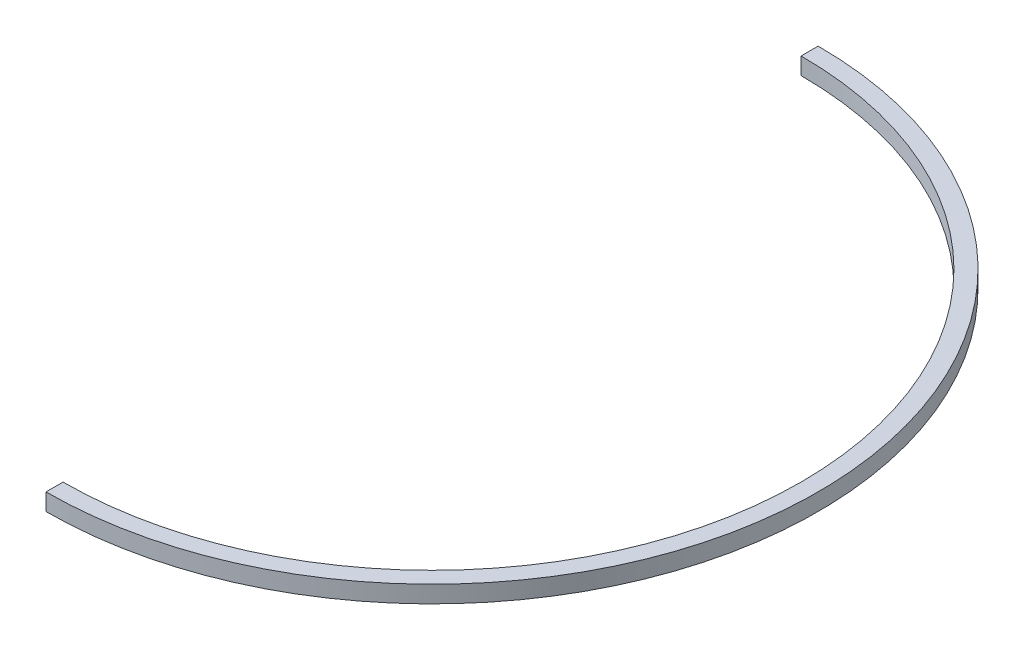
ISO-10303-21;
HEADER;
FILE_DESCRIPTION(('STEP AP214'),'2;1');
FILE_NAME('part.step','',(''),(''),'','','');
FILE_SCHEMA(('AUTOMOTIVE_DESIGN { 1 0 10303 214 1 1 1 1 }'));
ENDSEC;
DATA;
#1=APPLICATION_CONTEXT('core data for automotive mechanical design processes');
#2=APPLICATION_PROTOCOL_DEFINITION('international standard','automotive_design',2000,#1);
#3=PRODUCT_CONTEXT('',#1,'mechanical');
#4=PRODUCT('Part','Part','',(#3));
#5=PRODUCT_RELATED_PRODUCT_CATEGORY('part','',(#4));
#6=PRODUCT_DEFINITION_FORMATION('','',#4);
#7=PRODUCT_DEFINITION_CONTEXT('part definition',#1,'design');
#8=PRODUCT_DEFINITION('design','',#6,#7);
#9=PRODUCT_DEFINITION_SHAPE('','',#8);
#10=(LENGTH_UNIT() NAMED_UNIT(*) SI_UNIT(.MILLI.,.METRE.));
#11=(NAMED_UNIT(*) PLANE_ANGLE_UNIT() SI_UNIT($,.RADIAN.));
#12=(NAMED_UNIT(*) SI_UNIT($,.STERADIAN.) SOLID_ANGLE_UNIT());
#13=UNCERTAINTY_MEASURE_WITH_UNIT(LENGTH_MEASURE(1.E-05),#10,'distance_accuracy_value','');
#14=(GEOMETRIC_REPRESENTATION_CONTEXT(3) GLOBAL_UNCERTAINTY_ASSIGNED_CONTEXT((#13)) GLOBAL_UNIT_ASSIGNED_CONTEXT((#10,
#11,#12)) REPRESENTATION_CONTEXT('',''));
#15=CARTESIAN_POINT('',(0.,0.,0.));
#16=DIRECTION('',(0.,0.,1.));
#17=DIRECTION('',(1.,0.,0.));
#18=AXIS2_PLACEMENT_3D('',#15,#16,#17);
#19=CARTESIAN_POINT('',(0.,10.,0.));
#20=DIRECTION('',(0.,-1.,0.));
#21=DIRECTION('',(0.,0.,-1.));
#22=AXIS2_PLACEMENT_3D('',#19,#20,#21);
#23=CYLINDRICAL_SURFACE('',#22,226.5);
#24=CARTESIAN_POINT('',(0.,0.,0.));
#25=DIRECTION('',(0.,1.,0.));
#26=DIRECTION('',(0.,0.,1.));
#27=AXIS2_PLACEMENT_3D('',#24,#25,#26);
#28=CIRCLE('',#27,226.5);
#29=CARTESIAN_POINT('',(0.,0.,226.5));
#30=VERTEX_POINT('',#29);
#31=CARTESIAN_POINT('',(0.,0.,-226.5));
#32=VERTEX_POINT('',#31);
#33=EDGE_CURVE('E96',#30,#32,#28,.T.);
#34=ORIENTED_EDGE('',*,*,#33,.T.);
#35=DIRECTION('',(0.,-1.,0.));
#36=VECTOR('',#35,1.);
#37=CARTESIAN_POINT('',(0.,10.,-226.5));
#38=LINE('',#37,#36);
#39=CARTESIAN_POINT('',(0.,10.,-226.5));
#40=VERTEX_POINT('',#39);
#41=EDGE_CURVE('E11',#40,#32,#38,.T.);
#42=ORIENTED_EDGE('',*,*,#41,.F.);
#43=CARTESIAN_POINT('',(0.,10.,0.));
#44=DIRECTION('',(0.,1.,0.));
#45=DIRECTION('',(0.,0.,1.));
#46=AXIS2_PLACEMENT_3D('',#43,#44,#45);
#47=CIRCLE('',#46,226.5);
#48=CARTESIAN_POINT('',(0.,10.,226.5));
#49=VERTEX_POINT('',#48);
#50=EDGE_CURVE('E84',#49,#40,#47,.T.);
#51=ORIENTED_EDGE('',*,*,#50,.F.);
#52=DIRECTION('',(0.,-1.,0.));
#53=VECTOR('',#52,1.);
#54=CARTESIAN_POINT('',(0.,10.,226.5));
#55=LINE('',#54,#53);
#56=EDGE_CURVE('E92',#49,#30,#55,.T.);
#57=ORIENTED_EDGE('',*,*,#56,.T.);
#58=EDGE_LOOP('',(#34,#42,#51,#57));
#59=FACE_BOUND('',#58,.T.);
#60=ADVANCED_FACE('F33',(#59),#23,.T.);
#61=CARTESIAN_POINT('',(0.,10.,-216.5));
#62=DIRECTION('',(1.,0.,0.));
#63=DIRECTION('',(0.,0.,-1.));
#64=AXIS2_PLACEMENT_3D('',#61,#62,#63);
#65=PLANE('',#64);
#66=DIRECTION('',(0.,0.,1.));
#67=VECTOR('',#66,1.);
#68=CARTESIAN_POINT('',(0.,0.,-216.5));
#69=LINE('',#68,#67);
#70=CARTESIAN_POINT('',(0.,0.,-216.5));
#71=VERTEX_POINT('',#70);
#72=EDGE_CURVE('E88',#32,#71,#69,.T.);
#73=ORIENTED_EDGE('',*,*,#72,.T.);
#74=DIRECTION('',(0.,-1.,0.));
#75=VECTOR('',#74,1.);
#76=CARTESIAN_POINT('',(0.,10.,-216.5));
#77=LINE('',#76,#75);
#78=CARTESIAN_POINT('',(0.,10.,-216.5));
#79=VERTEX_POINT('',#78);
#80=EDGE_CURVE('E41',#79,#71,#77,.T.);
#81=ORIENTED_EDGE('',*,*,#80,.F.);
#82=DIRECTION('',(0.,0.,1.));
#83=VECTOR('',#82,1.);
#84=CARTESIAN_POINT('',(0.,10.,-216.5));
#85=LINE('',#84,#83);
#86=EDGE_CURVE('E79',#40,#79,#85,.T.);
#87=ORIENTED_EDGE('',*,*,#86,.F.);
#88=ORIENTED_EDGE('',*,*,#41,.T.);
#89=EDGE_LOOP('',(#73,#81,#87,#88));
#90=FACE_BOUND('',#89,.T.);
#91=ADVANCED_FACE('F87',(#90),#65,.F.);
#92=CARTESIAN_POINT('',(0.,10.,0.));
#93=DIRECTION('',(0.,-1.,0.));
#94=DIRECTION('',(0.,0.,-1.));
#95=AXIS2_PLACEMENT_3D('',#92,#93,#94);
#96=CYLINDRICAL_SURFACE('',#95,216.5);
#97=CARTESIAN_POINT('',(0.,0.,0.));
#98=DIRECTION('',(0.,-1.,0.));
#99=DIRECTION('',(0.,0.,1.));
#100=AXIS2_PLACEMENT_3D('',#97,#98,#99);
#101=CIRCLE('',#100,216.5);
#102=CARTESIAN_POINT('',(0.,0.,216.5));
#103=VERTEX_POINT('',#102);
#104=EDGE_CURVE('E66',#71,#103,#101,.T.);
#105=ORIENTED_EDGE('',*,*,#104,.T.);
#106=DIRECTION('',(0.,-1.,0.));
#107=VECTOR('',#106,1.);
#108=CARTESIAN_POINT('',(0.,10.,216.5));
#109=LINE('',#108,#107);
#110=CARTESIAN_POINT('',(0.,10.,216.5));
#111=VERTEX_POINT('',#110);
#112=EDGE_CURVE('E89',#111,#103,#109,.T.);
#113=ORIENTED_EDGE('',*,*,#112,.F.);
#114=CARTESIAN_POINT('',(0.,10.,0.));
#115=DIRECTION('',(0.,-1.,0.));
#116=DIRECTION('',(0.,0.,1.));
#117=AXIS2_PLACEMENT_3D('',#114,#115,#116);
#118=CIRCLE('',#117,216.5);
#119=EDGE_CURVE('E82',#79,#111,#118,.T.);
#120=ORIENTED_EDGE('',*,*,#119,.F.);
#121=ORIENTED_EDGE('',*,*,#80,.T.);
#122=EDGE_LOOP('',(#105,#113,#120,#121));
#123=FACE_BOUND('',#122,.T.);
#124=ADVANCED_FACE('F90',(#123),#96,.F.);
#125=CARTESIAN_POINT('',(0.,10.,216.5));
#126=DIRECTION('',(1.,0.,0.));
#127=DIRECTION('',(0.,0.,-1.));
#128=AXIS2_PLACEMENT_3D('',#125,#126,#127);
#129=PLANE('',#128);
#130=DIRECTION('',(0.,0.,1.));
#131=VECTOR('',#130,1.);
#132=CARTESIAN_POINT('',(0.,0.,216.5));
#133=LINE('',#132,#131);
#134=EDGE_CURVE('E72',#103,#30,#133,.T.);
#135=ORIENTED_EDGE('',*,*,#134,.T.);
#136=ORIENTED_EDGE('',*,*,#56,.F.);
#137=DIRECTION('',(0.,0.,1.));
#138=VECTOR('',#137,1.);
#139=CARTESIAN_POINT('',(0.,10.,216.5));
#140=LINE('',#139,#138);
#141=EDGE_CURVE('E49',#111,#49,#140,.T.);
#142=ORIENTED_EDGE('',*,*,#141,.F.);
#143=ORIENTED_EDGE('',*,*,#112,.T.);
#144=EDGE_LOOP('',(#135,#136,#142,#143));
#145=FACE_BOUND('',#144,.T.);
#146=ADVANCED_FACE('F103',(#145),#129,.F.);
#147=CARTESIAN_POINT('',(0.,10.,0.));
#148=DIRECTION('',(0.,1.,0.));
#149=DIRECTION('',(0.,0.,1.));
#150=AXIS2_PLACEMENT_3D('',#147,#148,#149);
#151=PLANE('',#150);
#152=ORIENTED_EDGE('',*,*,#50,.T.);
#153=ORIENTED_EDGE('',*,*,#86,.T.);
#154=ORIENTED_EDGE('',*,*,#119,.T.);
#155=ORIENTED_EDGE('',*,*,#141,.T.);
#156=EDGE_LOOP('',(#152,#153,#154,#155));
#157=FACE_BOUND('',#156,.T.);
#158=ADVANCED_FACE('F80',(#157),#151,.T.);
#159=CARTESIAN_POINT('',(0.,0.,0.));
#160=DIRECTION('',(0.,1.,0.));
#161=DIRECTION('',(0.,0.,1.));
#162=AXIS2_PLACEMENT_3D('',#159,#160,#161);
#163=PLANE('',#162);
#164=ORIENTED_EDGE('',*,*,#33,.F.);
#165=ORIENTED_EDGE('',*,*,#134,.F.);
#166=ORIENTED_EDGE('',*,*,#104,.F.);
#167=ORIENTED_EDGE('',*,*,#72,.F.);
#168=EDGE_LOOP('',(#164,#165,#166,#167));
#169=FACE_BOUND('',#168,.T.);
#170=ADVANCED_FACE('F106',(#169),#163,.F.);
#171=CLOSED_SHELL('',(#60,#91,#124,#146,#158,#170));
#172=MANIFOLD_SOLID_BREP('B2',#171);
#173=ADVANCED_BREP_SHAPE_REPRESENTATION('',(#18,#172),#14);
#174=SHAPE_DEFINITION_REPRESENTATION(#9,#173);
ENDSEC;
END-ISO-10303-21;
